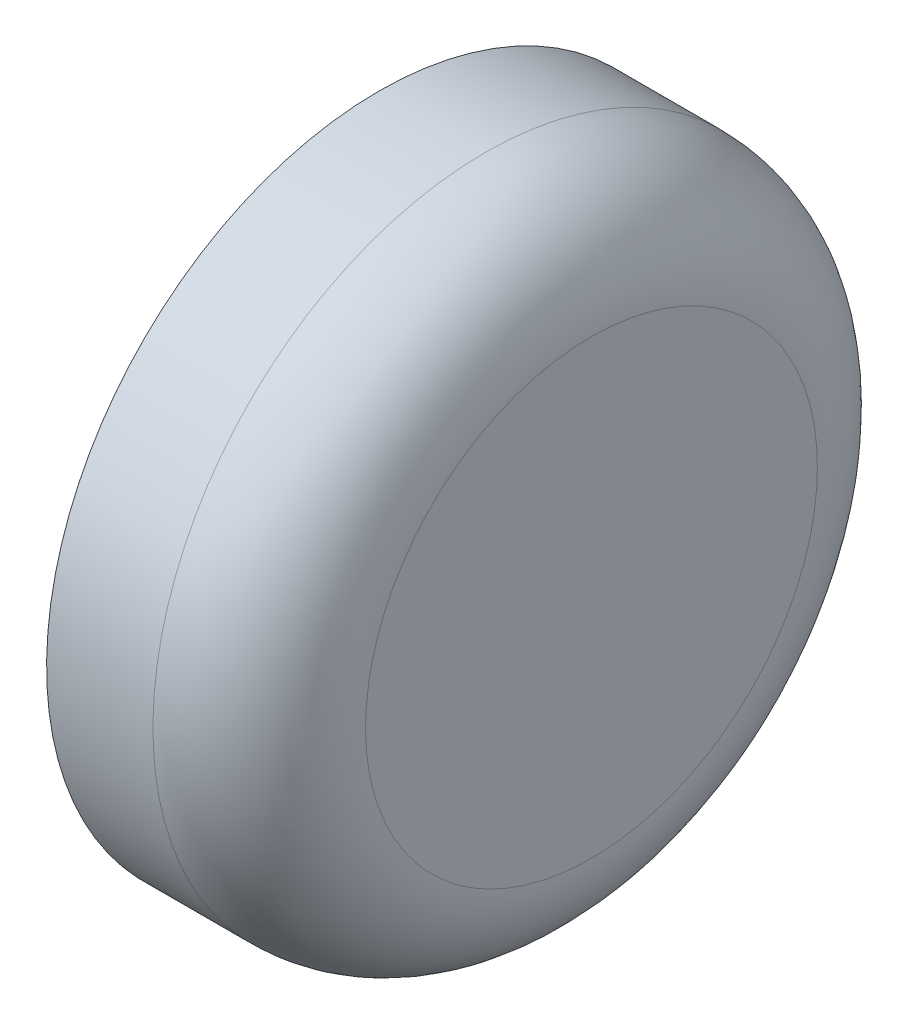
ISO-10303-21;
HEADER;
FILE_DESCRIPTION(('STEP AP214'),'2;1');
FILE_NAME('part.step','',(''),(''),'','','');
FILE_SCHEMA(('AUTOMOTIVE_DESIGN { 1 0 10303 214 1 1 1 1 }'));
ENDSEC;
DATA;
#1=APPLICATION_CONTEXT('core data for automotive mechanical design processes');
#2=APPLICATION_PROTOCOL_DEFINITION('international standard','automotive_design',2000,#1);
#3=PRODUCT_CONTEXT('',#1,'mechanical');
#4=PRODUCT('Part','Part','',(#3));
#5=PRODUCT_RELATED_PRODUCT_CATEGORY('part','',(#4));
#6=PRODUCT_DEFINITION_FORMATION('','',#4);
#7=PRODUCT_DEFINITION_CONTEXT('part definition',#1,'design');
#8=PRODUCT_DEFINITION('design','',#6,#7);
#9=PRODUCT_DEFINITION_SHAPE('','',#8);
#10=(LENGTH_UNIT() NAMED_UNIT(*) SI_UNIT(.MILLI.,.METRE.));
#11=(NAMED_UNIT(*) PLANE_ANGLE_UNIT() SI_UNIT($,.RADIAN.));
#12=(NAMED_UNIT(*) SI_UNIT($,.STERADIAN.) SOLID_ANGLE_UNIT());
#13=UNCERTAINTY_MEASURE_WITH_UNIT(LENGTH_MEASURE(1.E-05),#10,'distance_accuracy_value','');
#14=(GEOMETRIC_REPRESENTATION_CONTEXT(3) GLOBAL_UNCERTAINTY_ASSIGNED_CONTEXT((#13)) GLOBAL_UNIT_ASSIGNED_CONTEXT((#10,
#11,#12)) REPRESENTATION_CONTEXT('',''));
#15=CARTESIAN_POINT('',(0.,0.,0.));
#16=DIRECTION('',(0.,0.,1.));
#17=DIRECTION('',(1.,0.,0.));
#18=AXIS2_PLACEMENT_3D('',#15,#16,#17);
#19=CARTESIAN_POINT('',(-0.945364285309383,-0.332340218761648,0.1012));
#20=DIRECTION('',(1.,0.,0.));
#21=DIRECTION('',(0.,1.,0.));
#22=AXIS2_PLACEMENT_3D('',#19,#20,#21);
#23=PLANE('',#22);
#24=CARTESIAN_POINT('',(-0.945364285309383,-0.332340218761648,0.1012));
#25=DIRECTION('',(-1.,0.,0.));
#26=DIRECTION('',(0.,0.,1.));
#27=AXIS2_PLACEMENT_3D('',#24,#25,#26);
#28=CIRCLE('',#27,0.02125);
#29=CARTESIAN_POINT('',(-0.945364285309383,-0.332340218761648,0.12245));
#30=VERTEX_POINT('',#29);
#31=CARTESIAN_POINT('',(-0.945364285309383,-0.311090218761648,0.1012));
#32=VERTEX_POINT('',#31);
#33=EDGE_CURVE('E41',#30,#32,#28,.T.);
#34=ORIENTED_EDGE('',*,*,#33,.F.);
#35=CARTESIAN_POINT('',(-0.945364285309383,-0.332340218761648,0.1012));
#36=DIRECTION('',(-1.,0.,0.));
#37=DIRECTION('',(0.,0.,-1.));
#38=AXIS2_PLACEMENT_3D('',#35,#36,#37);
#39=CIRCLE('',#38,0.0212499999999999);
#40=CARTESIAN_POINT('',(-0.945364285309383,-0.332340218761648,0.07995));
#41=VERTEX_POINT('',#40);
#42=EDGE_CURVE('E43',#41,#30,#39,.T.);
#43=ORIENTED_EDGE('',*,*,#42,.F.);
#44=CARTESIAN_POINT('',(-0.945364285309383,-0.332340218761648,0.1012));
#45=DIRECTION('',(-1.,0.,0.));
#46=DIRECTION('',(0.,1.,0.));
#47=AXIS2_PLACEMENT_3D('',#44,#45,#46);
#48=CIRCLE('',#47,0.02125);
#49=EDGE_CURVE('E35',#32,#41,#48,.T.);
#50=ORIENTED_EDGE('',*,*,#49,.F.);
#51=EDGE_LOOP('',(#34,#43,#50));
#52=FACE_BOUND('',#51,.T.);
#53=ADVANCED_FACE('F17',(#52),#23,.T.);
#54=CARTESIAN_POINT('',(-0.955364285309383,-0.332340218761648,0.1012));
#55=DIRECTION('',(1.,0.,0.));
#56=DIRECTION('',(0.,0.,1.));
#57=AXIS2_PLACEMENT_3D('',#54,#55,#56);
#58=TOROIDAL_SURFACE('',#57,0.02125,0.01);
#59=ORIENTED_EDGE('',*,*,#42,.T.);
#60=ORIENTED_EDGE('',*,*,#33,.T.);
#61=ORIENTED_EDGE('',*,*,#49,.T.);
#62=EDGE_LOOP('',(#59,#60,#61));
#63=FACE_BOUND('',#62,.T.);
#64=CARTESIAN_POINT('',(-0.955364285309383,-0.332340218761648,0.1012));
#65=DIRECTION('',(1.,0.,0.));
#66=DIRECTION('',(0.,1.,0.));
#67=AXIS2_PLACEMENT_3D('',#64,#65,#66);
#68=CIRCLE('',#67,0.03125);
#69=CARTESIAN_POINT('',(-0.955364285309383,-0.301090218761648,0.1012));
#70=VERTEX_POINT('',#69);
#71=EDGE_CURVE('E27',#70,#70,#68,.F.);
#72=ORIENTED_EDGE('',*,*,#71,.F.);
#73=EDGE_LOOP('',(#72));
#74=FACE_BOUND('',#73,.T.);
#75=ADVANCED_FACE('F44',(#63,#74),#58,.T.);
#76=CARTESIAN_POINT('',(-0.945364285309383,-0.332340218761648,0.1012));
#77=DIRECTION('',(1.,0.,0.));
#78=DIRECTION('',(0.,1.,0.));
#79=AXIS2_PLACEMENT_3D('',#76,#77,#78);
#80=CYLINDRICAL_SURFACE('',#79,0.03125);
#81=CARTESIAN_POINT('',(-0.965364285309383,-0.332340218761648,0.1012));
#82=DIRECTION('',(1.,0.,0.));
#83=DIRECTION('',(0.,1.,0.));
#84=AXIS2_PLACEMENT_3D('',#81,#82,#83);
#85=CIRCLE('',#84,0.03125);
#86=CARTESIAN_POINT('',(-0.965364285309383,-0.301090218761648,0.1012));
#87=VERTEX_POINT('',#86);
#88=EDGE_CURVE('E11',#87,#87,#85,.T.);
#89=ORIENTED_EDGE('',*,*,#88,.T.);
#90=EDGE_LOOP('',(#89));
#91=FACE_BOUND('',#90,.T.);
#92=ORIENTED_EDGE('',*,*,#71,.T.);
#93=EDGE_LOOP('',(#92));
#94=FACE_BOUND('',#93,.T.);
#95=ADVANCED_FACE('F82',(#91,#94),#80,.T.);
#96=CARTESIAN_POINT('',(-0.965364285309383,-0.332340218761648,0.1012));
#97=DIRECTION('',(1.,0.,0.));
#98=DIRECTION('',(0.,1.,0.));
#99=AXIS2_PLACEMENT_3D('',#96,#97,#98);
#100=PLANE('',#99);
#101=ORIENTED_EDGE('',*,*,#88,.F.);
#102=EDGE_LOOP('',(#101));
#103=FACE_BOUND('',#102,.T.);
#104=ADVANCED_FACE('F92',(#103),#100,.F.);
#105=CLOSED_SHELL('',(#53,#75,#95,#104));
#106=MANIFOLD_SOLID_BREP('B1',#105);
#107=ADVANCED_BREP_SHAPE_REPRESENTATION('',(#18,#106),#14);
#108=SHAPE_DEFINITION_REPRESENTATION(#9,#107);
ENDSEC;
END-ISO-10303-21;
